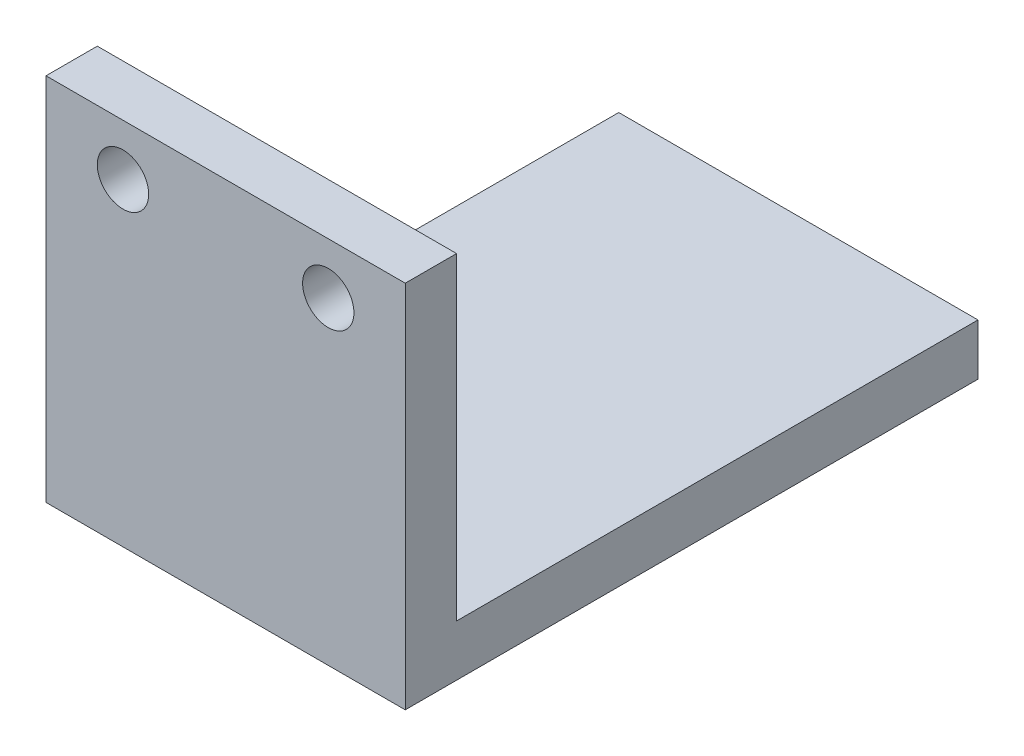
ISO-10303-21;
HEADER;
FILE_DESCRIPTION(('STEP AP214'),'2;1');
FILE_NAME('part.step','',(''),(''),'','','');
FILE_SCHEMA(('AUTOMOTIVE_DESIGN { 1 0 10303 214 1 1 1 1 }'));
ENDSEC;
DATA;
#1=APPLICATION_CONTEXT('core data for automotive mechanical design processes');
#2=APPLICATION_PROTOCOL_DEFINITION('international standard','automotive_design',2000,#1);
#3=PRODUCT_CONTEXT('',#1,'mechanical');
#4=PRODUCT('Part','Part','',(#3));
#5=PRODUCT_RELATED_PRODUCT_CATEGORY('part','',(#4));
#6=PRODUCT_DEFINITION_FORMATION('','',#4);
#7=PRODUCT_DEFINITION_CONTEXT('part definition',#1,'design');
#8=PRODUCT_DEFINITION('design','',#6,#7);
#9=PRODUCT_DEFINITION_SHAPE('','',#8);
#10=(LENGTH_UNIT() NAMED_UNIT(*) SI_UNIT(.MILLI.,.METRE.));
#11=(NAMED_UNIT(*) PLANE_ANGLE_UNIT() SI_UNIT($,.RADIAN.));
#12=(NAMED_UNIT(*) SI_UNIT($,.STERADIAN.) SOLID_ANGLE_UNIT());
#13=UNCERTAINTY_MEASURE_WITH_UNIT(LENGTH_MEASURE(1.E-05),#10,'distance_accuracy_value','');
#14=(GEOMETRIC_REPRESENTATION_CONTEXT(3) GLOBAL_UNCERTAINTY_ASSIGNED_CONTEXT((#13)) GLOBAL_UNIT_ASSIGNED_CONTEXT((#10,
#11,#12)) REPRESENTATION_CONTEXT('',''));
#15=CARTESIAN_POINT('',(0.,0.,0.));
#16=DIRECTION('',(0.,0.,1.));
#17=DIRECTION('',(1.,0.,0.));
#18=AXIS2_PLACEMENT_3D('',#15,#16,#17);
#19=CARTESIAN_POINT('',(0.,0.,5.));
#20=DIRECTION('',(0.,0.,1.));
#21=DIRECTION('',(1.,0.,0.));
#22=AXIS2_PLACEMENT_3D('',#19,#20,#21);
#23=PLANE('',#22);
#24=CARTESIAN_POINT('',(-10.,0.,5.));
#25=DIRECTION('',(0.,0.,1.));
#26=DIRECTION('',(1.,0.,0.));
#27=AXIS2_PLACEMENT_3D('',#24,#25,#26);
#28=CIRCLE('',#27,2.5);
#29=CARTESIAN_POINT('',(-7.5,0.,5.));
#30=VERTEX_POINT('',#29);
#31=EDGE_CURVE('E88',#30,#30,#28,.T.);
#32=ORIENTED_EDGE('',*,*,#31,.F.);
#33=EDGE_LOOP('',(#32));
#34=FACE_BOUND('',#33,.T.);
#35=DIRECTION('',(0.,-1.,0.));
#36=VECTOR('',#35,1.);
#37=CARTESIAN_POINT('',(-17.5,5.,5.));
#38=LINE('',#37,#36);
#39=CARTESIAN_POINT('',(-17.5,5.,5.));
#40=VERTEX_POINT('',#39);
#41=CARTESIAN_POINT('',(-17.5,-31.,5.));
#42=VERTEX_POINT('',#41);
#43=EDGE_CURVE('E93',#40,#42,#38,.T.);
#44=ORIENTED_EDGE('',*,*,#43,.T.);
#45=DIRECTION('',(-1.,0.,0.));
#46=VECTOR('',#45,1.);
#47=CARTESIAN_POINT('',(-17.5,-31.,5.));
#48=LINE('',#47,#46);
#49=CARTESIAN_POINT('',(17.5,-31.,5.));
#50=VERTEX_POINT('',#49);
#51=EDGE_CURVE('E120',#50,#42,#48,.T.);
#52=ORIENTED_EDGE('',*,*,#51,.F.);
#53=DIRECTION('',(0.,1.,0.));
#54=VECTOR('',#53,1.);
#55=CARTESIAN_POINT('',(17.5,-5.,5.));
#56=LINE('',#55,#54);
#57=CARTESIAN_POINT('',(17.5,5.,5.));
#58=VERTEX_POINT('',#57);
#59=EDGE_CURVE('E96',#50,#58,#56,.T.);
#60=ORIENTED_EDGE('',*,*,#59,.T.);
#61=DIRECTION('',(-1.,0.,0.));
#62=VECTOR('',#61,1.);
#63=CARTESIAN_POINT('',(-17.5,5.,5.));
#64=LINE('',#63,#62);
#65=EDGE_CURVE('E58',#58,#40,#64,.T.);
#66=ORIENTED_EDGE('',*,*,#65,.T.);
#67=EDGE_LOOP('',(#44,#52,#60,#66));
#68=FACE_BOUND('',#67,.T.);
#69=CARTESIAN_POINT('',(10.,0.,5.));
#70=DIRECTION('',(0.,0.,1.));
#71=DIRECTION('',(1.,0.,0.));
#72=AXIS2_PLACEMENT_3D('',#69,#70,#71);
#73=CIRCLE('',#72,2.5);
#74=CARTESIAN_POINT('',(12.5,0.,5.));
#75=VERTEX_POINT('',#74);
#76=EDGE_CURVE('E106',#75,#75,#73,.T.);
#77=ORIENTED_EDGE('',*,*,#76,.F.);
#78=EDGE_LOOP('',(#77));
#79=FACE_BOUND('',#78,.T.);
#80=ADVANCED_FACE('F41',(#34,#68,#79),#23,.T.);
#81=CARTESIAN_POINT('',(0.,0.,0.));
#82=DIRECTION('',(0.,0.,1.));
#83=DIRECTION('',(1.,0.,0.));
#84=AXIS2_PLACEMENT_3D('',#81,#82,#83);
#85=PLANE('',#84);
#86=DIRECTION('',(0.,-1.,0.));
#87=VECTOR('',#86,1.);
#88=CARTESIAN_POINT('',(-17.5,-5.,0.));
#89=LINE('',#88,#87);
#90=CARTESIAN_POINT('',(-17.5,5.,0.));
#91=VERTEX_POINT('',#90);
#92=CARTESIAN_POINT('',(-17.5,-26.,0.));
#93=VERTEX_POINT('',#92);
#94=EDGE_CURVE('E77',#91,#93,#89,.T.);
#95=ORIENTED_EDGE('',*,*,#94,.F.);
#96=DIRECTION('',(-1.,0.,0.));
#97=VECTOR('',#96,1.);
#98=CARTESIAN_POINT('',(-17.5,5.,0.));
#99=LINE('',#98,#97);
#100=CARTESIAN_POINT('',(17.5,5.,0.));
#101=VERTEX_POINT('',#100);
#102=EDGE_CURVE('E81',#101,#91,#99,.T.);
#103=ORIENTED_EDGE('',*,*,#102,.F.);
#104=DIRECTION('',(0.,1.,0.));
#105=VECTOR('',#104,1.);
#106=CARTESIAN_POINT('',(17.5,5.,0.));
#107=LINE('',#106,#105);
#108=CARTESIAN_POINT('',(17.5,-26.,0.));
#109=VERTEX_POINT('',#108);
#110=EDGE_CURVE('E72',#109,#101,#107,.T.);
#111=ORIENTED_EDGE('',*,*,#110,.F.);
#112=DIRECTION('',(1.,0.,0.));
#113=VECTOR('',#112,1.);
#114=CARTESIAN_POINT('',(-17.5,-26.,0.));
#115=LINE('',#114,#113);
#116=EDGE_CURVE('E83',#93,#109,#115,.T.);
#117=ORIENTED_EDGE('',*,*,#116,.F.);
#118=EDGE_LOOP('',(#95,#103,#111,#117));
#119=FACE_BOUND('',#118,.T.);
#120=CARTESIAN_POINT('',(-10.,0.,0.));
#121=DIRECTION('',(0.,0.,1.));
#122=DIRECTION('',(1.,0.,0.));
#123=AXIS2_PLACEMENT_3D('',#120,#121,#122);
#124=CIRCLE('',#123,2.5);
#125=CARTESIAN_POINT('',(-7.5,0.,0.));
#126=VERTEX_POINT('',#125);
#127=EDGE_CURVE('E103',#126,#126,#124,.T.);
#128=ORIENTED_EDGE('',*,*,#127,.T.);
#129=EDGE_LOOP('',(#128));
#130=FACE_BOUND('',#129,.T.);
#131=CARTESIAN_POINT('',(10.,0.,0.));
#132=DIRECTION('',(0.,0.,1.));
#133=DIRECTION('',(1.,0.,0.));
#134=AXIS2_PLACEMENT_3D('',#131,#132,#133);
#135=CIRCLE('',#134,2.5);
#136=CARTESIAN_POINT('',(12.5,0.,0.));
#137=VERTEX_POINT('',#136);
#138=EDGE_CURVE('E109',#137,#137,#135,.T.);
#139=ORIENTED_EDGE('',*,*,#138,.T.);
#140=EDGE_LOOP('',(#139));
#141=FACE_BOUND('',#140,.T.);
#142=ADVANCED_FACE('F79',(#119,#130,#141),#85,.F.);
#143=CARTESIAN_POINT('',(-17.5,-5.,5.));
#144=DIRECTION('',(1.,0.,0.));
#145=DIRECTION('',(0.,1.,0.));
#146=AXIS2_PLACEMENT_3D('',#143,#144,#145);
#147=PLANE('',#146);
#148=ORIENTED_EDGE('',*,*,#94,.T.);
#149=DIRECTION('',(0.,0.,-1.));
#150=VECTOR('',#149,1.);
#151=CARTESIAN_POINT('',(-17.5,-26.,5.));
#152=LINE('',#151,#150);
#153=CARTESIAN_POINT('',(-17.5,-26.,-50.8));
#154=VERTEX_POINT('',#153);
#155=EDGE_CURVE('E127',#93,#154,#152,.T.);
#156=ORIENTED_EDGE('',*,*,#155,.T.);
#157=DIRECTION('',(0.,1.,0.));
#158=VECTOR('',#157,1.);
#159=CARTESIAN_POINT('',(-17.5,-31.,-50.8));
#160=LINE('',#159,#158);
#161=CARTESIAN_POINT('',(-17.5,-31.,-50.8));
#162=VERTEX_POINT('',#161);
#163=EDGE_CURVE('E112',#162,#154,#160,.T.);
#164=ORIENTED_EDGE('',*,*,#163,.F.);
#165=DIRECTION('',(0.,0.,-1.));
#166=VECTOR('',#165,1.);
#167=CARTESIAN_POINT('',(-17.5,-31.,5.));
#168=LINE('',#167,#166);
#169=EDGE_CURVE('E123',#42,#162,#168,.T.);
#170=ORIENTED_EDGE('',*,*,#169,.F.);
#171=ORIENTED_EDGE('',*,*,#43,.F.);
#172=DIRECTION('',(0.,0.,-1.));
#173=VECTOR('',#172,1.);
#174=CARTESIAN_POINT('',(-17.5,5.,5.));
#175=LINE('',#174,#173);
#176=EDGE_CURVE('E50',#40,#91,#175,.T.);
#177=ORIENTED_EDGE('',*,*,#176,.T.);
#178=EDGE_LOOP('',(#148,#156,#164,#170,#171,#177));
#179=FACE_BOUND('',#178,.T.);
#180=ADVANCED_FACE('F43',(#179),#147,.F.);
#181=CARTESIAN_POINT('',(17.5,5.,5.));
#182=DIRECTION('',(-1.,0.,0.));
#183=DIRECTION('',(0.,0.,1.));
#184=AXIS2_PLACEMENT_3D('',#181,#182,#183);
#185=PLANE('',#184);
#186=ORIENTED_EDGE('',*,*,#110,.T.);
#187=DIRECTION('',(0.,0.,-1.));
#188=VECTOR('',#187,1.);
#189=CARTESIAN_POINT('',(17.5,5.,5.));
#190=LINE('',#189,#188);
#191=EDGE_CURVE('E11',#58,#101,#190,.T.);
#192=ORIENTED_EDGE('',*,*,#191,.F.);
#193=ORIENTED_EDGE('',*,*,#59,.F.);
#194=DIRECTION('',(0.,0.,1.));
#195=VECTOR('',#194,1.);
#196=CARTESIAN_POINT('',(17.5,-31.,5.));
#197=LINE('',#196,#195);
#198=CARTESIAN_POINT('',(17.5,-31.,-50.8));
#199=VERTEX_POINT('',#198);
#200=EDGE_CURVE('E132',#199,#50,#197,.T.);
#201=ORIENTED_EDGE('',*,*,#200,.F.);
#202=DIRECTION('',(0.,1.,0.));
#203=VECTOR('',#202,1.);
#204=CARTESIAN_POINT('',(17.5,-31.,-50.8));
#205=LINE('',#204,#203);
#206=CARTESIAN_POINT('',(17.5,-26.,-50.8));
#207=VERTEX_POINT('',#206);
#208=EDGE_CURVE('E117',#199,#207,#205,.T.);
#209=ORIENTED_EDGE('',*,*,#208,.T.);
#210=DIRECTION('',(0.,0.,1.));
#211=VECTOR('',#210,1.);
#212=CARTESIAN_POINT('',(17.5,-26.,5.));
#213=LINE('',#212,#211);
#214=EDGE_CURVE('E121',#207,#109,#213,.T.);
#215=ORIENTED_EDGE('',*,*,#214,.T.);
#216=EDGE_LOOP('',(#186,#192,#193,#201,#209,#215));
#217=FACE_BOUND('',#216,.T.);
#218=ADVANCED_FACE('F179',(#217),#185,.F.);
#219=CARTESIAN_POINT('',(-17.5,5.,5.));
#220=DIRECTION('',(0.,-1.,0.));
#221=DIRECTION('',(1.,0.,0.));
#222=AXIS2_PLACEMENT_3D('',#219,#220,#221);
#223=PLANE('',#222);
#224=ORIENTED_EDGE('',*,*,#102,.T.);
#225=ORIENTED_EDGE('',*,*,#176,.F.);
#226=ORIENTED_EDGE('',*,*,#65,.F.);
#227=ORIENTED_EDGE('',*,*,#191,.T.);
#228=EDGE_LOOP('',(#224,#225,#226,#227));
#229=FACE_BOUND('',#228,.T.);
#230=ADVANCED_FACE('F91',(#229),#223,.F.);
#231=CARTESIAN_POINT('',(-10.,0.,5.));
#232=DIRECTION('',(0.,0.,-1.));
#233=DIRECTION('',(-1.,0.,0.));
#234=AXIS2_PLACEMENT_3D('',#231,#232,#233);
#235=CYLINDRICAL_SURFACE('',#234,2.5);
#236=ORIENTED_EDGE('',*,*,#31,.T.);
#237=EDGE_LOOP('',(#236));
#238=FACE_BOUND('',#237,.T.);
#239=ORIENTED_EDGE('',*,*,#127,.F.);
#240=EDGE_LOOP('',(#239));
#241=FACE_BOUND('',#240,.T.);
#242=ADVANCED_FACE('F175',(#238,#241),#235,.F.);
#243=CARTESIAN_POINT('',(10.,0.,5.));
#244=DIRECTION('',(0.,0.,-1.));
#245=DIRECTION('',(-1.,0.,0.));
#246=AXIS2_PLACEMENT_3D('',#243,#244,#245);
#247=CYLINDRICAL_SURFACE('',#246,2.5);
#248=ORIENTED_EDGE('',*,*,#76,.T.);
#249=EDGE_LOOP('',(#248));
#250=FACE_BOUND('',#249,.T.);
#251=ORIENTED_EDGE('',*,*,#138,.F.);
#252=EDGE_LOOP('',(#251));
#253=FACE_BOUND('',#252,.T.);
#254=ADVANCED_FACE('F161',(#250,#253),#247,.F.);
#255=CARTESIAN_POINT('',(0.,-26.,0.));
#256=DIRECTION('',(0.,-1.,0.));
#257=DIRECTION('',(0.,0.,-1.));
#258=AXIS2_PLACEMENT_3D('',#255,#256,#257);
#259=PLANE('',#258);
#260=CARTESIAN_POINT('',(-12.5,-26.,-22.4));
#261=DIRECTION('',(0.,-1.,0.));
#262=DIRECTION('',(0.,0.,-1.));
#263=AXIS2_PLACEMENT_3D('',#260,#261,#262);
#264=CIRCLE('',#263,1.25);
#265=CARTESIAN_POINT('',(-12.5,-26.,-23.65));
#266=VERTEX_POINT('',#265);
#267=EDGE_CURVE('E140',#266,#266,#264,.T.);
#268=ORIENTED_EDGE('',*,*,#267,.T.);
#269=EDGE_LOOP('',(#268));
#270=FACE_BOUND('',#269,.T.);
#271=ORIENTED_EDGE('',*,*,#155,.F.);
#272=ORIENTED_EDGE('',*,*,#116,.T.);
#273=ORIENTED_EDGE('',*,*,#214,.F.);
#274=DIRECTION('',(1.,0.,0.));
#275=VECTOR('',#274,1.);
#276=CARTESIAN_POINT('',(-17.5,-26.,-50.8));
#277=LINE('',#276,#275);
#278=EDGE_CURVE('E124',#154,#207,#277,.T.);
#279=ORIENTED_EDGE('',*,*,#278,.F.);
#280=EDGE_LOOP('',(#271,#272,#273,#279));
#281=FACE_BOUND('',#280,.T.);
#282=ADVANCED_FACE('F152',(#270,#281),#259,.F.);
#283=CARTESIAN_POINT('',(0.,-31.,0.));
#284=DIRECTION('',(0.,-1.,0.));
#285=DIRECTION('',(0.,0.,-1.));
#286=AXIS2_PLACEMENT_3D('',#283,#284,#285);
#287=PLANE('',#286);
#288=ORIENTED_EDGE('',*,*,#169,.T.);
#289=DIRECTION('',(1.,0.,0.));
#290=VECTOR('',#289,1.);
#291=CARTESIAN_POINT('',(-17.5,-31.,-50.8));
#292=LINE('',#291,#290);
#293=EDGE_CURVE('E135',#162,#199,#292,.T.);
#294=ORIENTED_EDGE('',*,*,#293,.T.);
#295=ORIENTED_EDGE('',*,*,#200,.T.);
#296=ORIENTED_EDGE('',*,*,#51,.T.);
#297=EDGE_LOOP('',(#288,#294,#295,#296));
#298=FACE_BOUND('',#297,.T.);
#299=CARTESIAN_POINT('',(-12.5,-31.,-22.4));
#300=DIRECTION('',(0.,-1.,0.));
#301=DIRECTION('',(0.,0.,-1.));
#302=AXIS2_PLACEMENT_3D('',#299,#300,#301);
#303=CIRCLE('',#302,1.25);
#304=CARTESIAN_POINT('',(-12.5,-31.,-23.65));
#305=VERTEX_POINT('',#304);
#306=EDGE_CURVE('E129',#305,#305,#303,.T.);
#307=ORIENTED_EDGE('',*,*,#306,.F.);
#308=EDGE_LOOP('',(#307));
#309=FACE_BOUND('',#308,.T.);
#310=ADVANCED_FACE('F149',(#298,#309),#287,.T.);
#311=CARTESIAN_POINT('',(-17.5,-31.,-50.8));
#312=DIRECTION('',(0.,0.,1.));
#313=DIRECTION('',(1.,0.,0.));
#314=AXIS2_PLACEMENT_3D('',#311,#312,#313);
#315=PLANE('',#314);
#316=ORIENTED_EDGE('',*,*,#278,.T.);
#317=ORIENTED_EDGE('',*,*,#208,.F.);
#318=ORIENTED_EDGE('',*,*,#293,.F.);
#319=ORIENTED_EDGE('',*,*,#163,.T.);
#320=EDGE_LOOP('',(#316,#317,#318,#319));
#321=FACE_BOUND('',#320,.T.);
#322=ADVANCED_FACE('F151',(#321),#315,.F.);
#323=CARTESIAN_POINT('',(-12.5,-31.,-22.4));
#324=DIRECTION('',(0.,1.,0.));
#325=DIRECTION('',(0.,0.,1.));
#326=AXIS2_PLACEMENT_3D('',#323,#324,#325);
#327=CYLINDRICAL_SURFACE('',#326,1.25);
#328=ORIENTED_EDGE('',*,*,#306,.T.);
#329=EDGE_LOOP('',(#328));
#330=FACE_BOUND('',#329,.T.);
#331=ORIENTED_EDGE('',*,*,#267,.F.);
#332=EDGE_LOOP('',(#331));
#333=FACE_BOUND('',#332,.T.);
#334=ADVANCED_FACE('F146',(#330,#333),#327,.F.);
#335=CLOSED_SHELL('',(#80,#142,#180,#218,#230,#242,#254,#282,#310,#322,#334));
#336=MANIFOLD_SOLID_BREP('B2',#335);
#337=ADVANCED_BREP_SHAPE_REPRESENTATION('',(#18,#336),#14);
#338=SHAPE_DEFINITION_REPRESENTATION(#9,#337);
ENDSEC;
END-ISO-10303-21;
